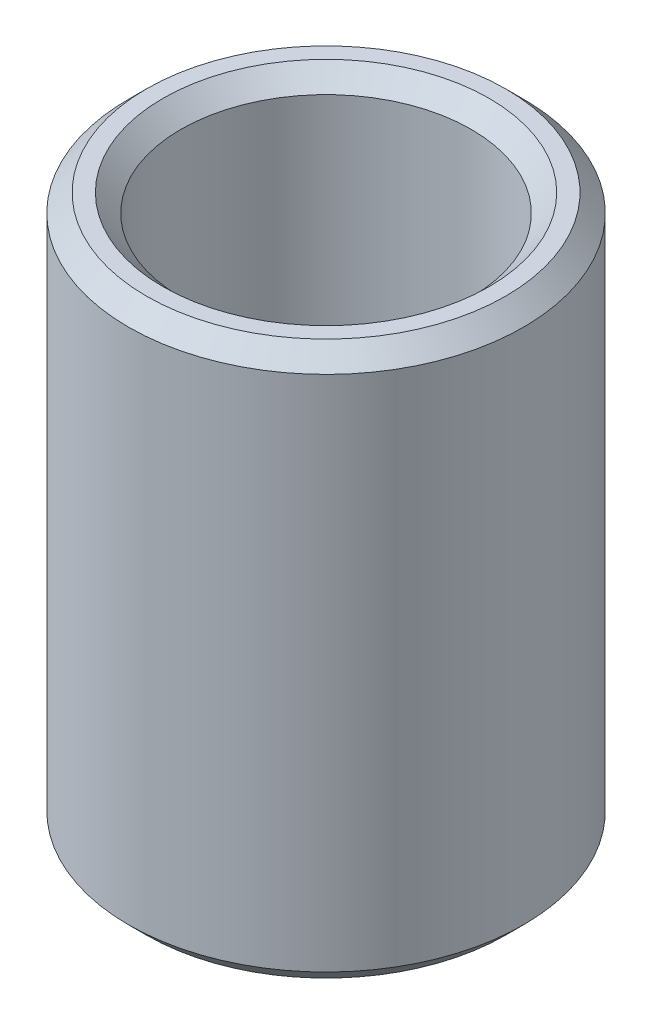
ISO-10303-21;
HEADER;
FILE_DESCRIPTION(('STEP AP214'),'2;1');
FILE_NAME('part.step','',(''),(''),'','','');
FILE_SCHEMA(('AUTOMOTIVE_DESIGN { 1 0 10303 214 1 1 1 1 }'));
ENDSEC;
DATA;
#1=APPLICATION_CONTEXT('core data for automotive mechanical design processes');
#2=APPLICATION_PROTOCOL_DEFINITION('international standard','automotive_design',2000,#1);
#3=PRODUCT_CONTEXT('',#1,'mechanical');
#4=PRODUCT('Part','Part','',(#3));
#5=PRODUCT_RELATED_PRODUCT_CATEGORY('part','',(#4));
#6=PRODUCT_DEFINITION_FORMATION('','',#4);
#7=PRODUCT_DEFINITION_CONTEXT('part definition',#1,'design');
#8=PRODUCT_DEFINITION('design','',#6,#7);
#9=PRODUCT_DEFINITION_SHAPE('','',#8);
#10=(LENGTH_UNIT() NAMED_UNIT(*) SI_UNIT(.MILLI.,.METRE.));
#11=(NAMED_UNIT(*) PLANE_ANGLE_UNIT() SI_UNIT($,.RADIAN.));
#12=(NAMED_UNIT(*) SI_UNIT($,.STERADIAN.) SOLID_ANGLE_UNIT());
#13=UNCERTAINTY_MEASURE_WITH_UNIT(LENGTH_MEASURE(1.E-05),#10,'distance_accuracy_value','');
#14=(GEOMETRIC_REPRESENTATION_CONTEXT(3) GLOBAL_UNCERTAINTY_ASSIGNED_CONTEXT((#13)) GLOBAL_UNIT_ASSIGNED_CONTEXT((#10,
#11,#12)) REPRESENTATION_CONTEXT('',''));
#15=CARTESIAN_POINT('',(0.,0.,0.));
#16=DIRECTION('',(0.,0.,1.));
#17=DIRECTION('',(1.,0.,0.));
#18=AXIS2_PLACEMENT_3D('',#15,#16,#17);
#19=CARTESIAN_POINT('',(0.,119.096016080644,0.));
#20=DIRECTION('',(0.,-1.,0.));
#21=DIRECTION('',(0.,0.,-1.));
#22=AXIS2_PLACEMENT_3D('',#19,#20,#21);
#23=CYLINDRICAL_SURFACE('',#22,42.5);
#24=CARTESIAN_POINT('',(0.,3.85326837927479,0.));
#25=DIRECTION('',(0.,1.,0.));
#26=DIRECTION('',(0.,0.,1.));
#27=AXIS2_PLACEMENT_3D('',#24,#25,#26);
#28=CIRCLE('',#27,42.5);
#29=CARTESIAN_POINT('',(0.,3.85326837927479,42.5));
#30=VERTEX_POINT('',#29);
#31=EDGE_CURVE('E10',#30,#30,#28,.T.);
#32=ORIENTED_EDGE('',*,*,#31,.T.);
#33=EDGE_LOOP('',(#32));
#34=FACE_BOUND('',#33,.T.);
#35=CARTESIAN_POINT('',(0.,115.242747701369,0.));
#36=DIRECTION('',(0.,1.,0.));
#37=DIRECTION('',(0.,0.,1.));
#38=AXIS2_PLACEMENT_3D('',#35,#36,#37);
#39=CIRCLE('',#38,42.5);
#40=CARTESIAN_POINT('',(0.,115.242747701369,42.5));
#41=VERTEX_POINT('',#40);
#42=EDGE_CURVE('E50',#41,#41,#39,.F.);
#43=ORIENTED_EDGE('',*,*,#42,.T.);
#44=EDGE_LOOP('',(#43));
#45=FACE_BOUND('',#44,.T.);
#46=ADVANCED_FACE('F39',(#34,#45),#23,.T.);
#47=CARTESIAN_POINT('',(0.,119.096016080644,0.));
#48=DIRECTION('',(0.,1.,0.));
#49=DIRECTION('',(0.,0.,1.));
#50=AXIS2_PLACEMENT_3D('',#47,#48,#49);
#51=PLANE('',#50);
#52=CARTESIAN_POINT('',(0.,119.096016080644,0.));
#53=DIRECTION('',(0.,1.,0.));
#54=DIRECTION('',(0.,0.,1.));
#55=AXIS2_PLACEMENT_3D('',#52,#53,#54);
#56=CIRCLE('',#55,35.1047241558845);
#57=CARTESIAN_POINT('',(0.,119.096016080644,35.1047241558845));
#58=VERTEX_POINT('',#57);
#59=EDGE_CURVE('E58',#58,#58,#56,.F.);
#60=ORIENTED_EDGE('',*,*,#59,.T.);
#61=EDGE_LOOP('',(#60));
#62=FACE_BOUND('',#61,.T.);
#63=CARTESIAN_POINT('',(0.,119.096016080644,0.));
#64=DIRECTION('',(0.,1.,0.));
#65=DIRECTION('',(0.,0.,1.));
#66=AXIS2_PLACEMENT_3D('',#63,#64,#65);
#67=CIRCLE('',#66,38.6467316207253);
#68=CARTESIAN_POINT('',(0.,119.096016080644,38.6467316207253));
#69=VERTEX_POINT('',#68);
#70=EDGE_CURVE('E61',#69,#69,#67,.T.);
#71=ORIENTED_EDGE('',*,*,#70,.T.);
#72=EDGE_LOOP('',(#71));
#73=FACE_BOUND('',#72,.T.);
#74=ADVANCED_FACE('F88',(#62,#73),#51,.T.);
#75=CARTESIAN_POINT('',(0.,0.,0.));
#76=DIRECTION('',(0.,1.,0.));
#77=DIRECTION('',(0.,0.,1.));
#78=AXIS2_PLACEMENT_3D('',#75,#76,#77);
#79=PLANE('',#78);
#80=CARTESIAN_POINT('',(0.,0.,0.));
#81=DIRECTION('',(0.,1.,0.));
#82=DIRECTION('',(0.,0.,1.));
#83=AXIS2_PLACEMENT_3D('',#80,#81,#82);
#84=CIRCLE('',#83,35.1047241558845);
#85=CARTESIAN_POINT('',(0.,0.,35.1047241558845));
#86=VERTEX_POINT('',#85);
#87=EDGE_CURVE('E51',#86,#86,#84,.T.);
#88=ORIENTED_EDGE('',*,*,#87,.T.);
#89=EDGE_LOOP('',(#88));
#90=FACE_BOUND('',#89,.T.);
#91=CARTESIAN_POINT('',(0.,0.,0.));
#92=DIRECTION('',(0.,1.,0.));
#93=DIRECTION('',(0.,0.,1.));
#94=AXIS2_PLACEMENT_3D('',#91,#92,#93);
#95=CIRCLE('',#94,38.6467316207252);
#96=CARTESIAN_POINT('',(0.,0.,38.6467316207252));
#97=VERTEX_POINT('',#96);
#98=EDGE_CURVE('E54',#97,#97,#95,.F.);
#99=ORIENTED_EDGE('',*,*,#98,.T.);
#100=EDGE_LOOP('',(#99));
#101=FACE_BOUND('',#100,.T.);
#102=ADVANCED_FACE('F83',(#90,#101),#79,.F.);
#103=CARTESIAN_POINT('',(0.,119.096016080644,0.));
#104=DIRECTION('',(0.,-1.,0.));
#105=DIRECTION('',(0.,0.,-1.));
#106=AXIS2_PLACEMENT_3D('',#103,#104,#105);
#107=CYLINDRICAL_SURFACE('',#106,31.2514557766097);
#108=CARTESIAN_POINT('',(0.,115.242747701369,0.));
#109=DIRECTION('',(0.,1.,0.));
#110=DIRECTION('',(0.,0.,1.));
#111=AXIS2_PLACEMENT_3D('',#108,#109,#110);
#112=CIRCLE('',#111,31.2514557766097);
#113=CARTESIAN_POINT('',(0.,115.242747701369,31.2514557766097));
#114=VERTEX_POINT('',#113);
#115=EDGE_CURVE('E67',#114,#114,#112,.T.);
#116=ORIENTED_EDGE('',*,*,#115,.T.);
#117=EDGE_LOOP('',(#116));
#118=FACE_BOUND('',#117,.T.);
#119=CARTESIAN_POINT('',(0.,3.85326837927477,0.));
#120=DIRECTION('',(0.,1.,0.));
#121=DIRECTION('',(0.,0.,1.));
#122=AXIS2_PLACEMENT_3D('',#119,#120,#121);
#123=CIRCLE('',#122,31.2514557766097);
#124=CARTESIAN_POINT('',(0.,3.85326837927477,31.2514557766097));
#125=VERTEX_POINT('',#124);
#126=EDGE_CURVE('E69',#125,#125,#123,.F.);
#127=ORIENTED_EDGE('',*,*,#126,.T.);
#128=EDGE_LOOP('',(#127));
#129=FACE_BOUND('',#128,.T.);
#130=ADVANCED_FACE('F71',(#118,#129),#107,.F.);
#131=CARTESIAN_POINT('',(0.,115.242747701369,0.));
#132=DIRECTION('',(0.,1.,0.));
#133=DIRECTION('',(0.,0.,1.));
#134=AXIS2_PLACEMENT_3D('',#131,#132,#133);
#135=CONICAL_SURFACE('',#134,31.2514557766097,0.785398163397451);
#136=ORIENTED_EDGE('',*,*,#59,.F.);
#137=EDGE_LOOP('',(#136));
#138=FACE_BOUND('',#137,.T.);
#139=ORIENTED_EDGE('',*,*,#115,.F.);
#140=EDGE_LOOP('',(#139));
#141=FACE_BOUND('',#140,.T.);
#142=ADVANCED_FACE('F77',(#138,#141),#135,.F.);
#143=CARTESIAN_POINT('',(0.,0.,0.));
#144=DIRECTION('',(0.,-1.,0.));
#145=DIRECTION('',(0.,0.,-1.));
#146=AXIS2_PLACEMENT_3D('',#143,#144,#145);
#147=CONICAL_SURFACE('',#146,35.1047241558845,0.785398163397446);
#148=ORIENTED_EDGE('',*,*,#126,.F.);
#149=EDGE_LOOP('',(#148));
#150=FACE_BOUND('',#149,.T.);
#151=ORIENTED_EDGE('',*,*,#87,.F.);
#152=EDGE_LOOP('',(#151));
#153=FACE_BOUND('',#152,.T.);
#154=ADVANCED_FACE('F73',(#150,#153),#147,.F.);
#155=CARTESIAN_POINT('',(0.,3.85326837927479,0.));
#156=DIRECTION('',(0.,1.,0.));
#157=DIRECTION('',(0.,0.,1.));
#158=AXIS2_PLACEMENT_3D('',#155,#156,#157);
#159=CONICAL_SURFACE('',#158,42.5,0.78539816339745);
#160=CARTESIAN_POINT('',(0.,0.,38.6467316207252));
#161=CARTESIAN_POINT('',(0.,0.0401382122841138,38.6868698330093));
#162=CARTESIAN_POINT('',(0.,0.0802764245682255,38.7270080452934));
#163=CARTESIAN_POINT('',(0.,0.160552849136449,38.8072844698617));
#164=CARTESIAN_POINT('',(0.,0.200691061420561,38.8474226821458));
#165=CARTESIAN_POINT('',(0.,0.280967485988786,38.927699106714));
#166=CARTESIAN_POINT('',(0.,0.321105698272899,38.9678373189981));
#167=CARTESIAN_POINT('',(0.,0.401382122841124,39.0481137435663));
#168=CARTESIAN_POINT('',(0.,0.441520335125235,39.0882519558504));
#169=CARTESIAN_POINT('',(0.,0.521796759693459,39.1685283804187));
#170=CARTESIAN_POINT('',(0.,0.561934971977573,39.2086665927028));
#171=CARTESIAN_POINT('',(0.,0.642211396545798,39.288943017271));
#172=CARTESIAN_POINT('',(0.,0.682349608829909,39.3290812295551));
#173=CARTESIAN_POINT('',(0.,0.762626033398134,39.4093576541233));
#174=CARTESIAN_POINT('',(0.,0.802764245682247,39.4494958664075));
#175=CARTESIAN_POINT('',(0.,0.883040670250472,39.5297722909757));
#176=CARTESIAN_POINT('',(0.,0.923178882534583,39.5699105032598));
#177=CARTESIAN_POINT('',(0.,1.00345530710281,39.650186927828));
#178=CARTESIAN_POINT('',(0.,1.04359351938692,39.6903251401121));
#179=CARTESIAN_POINT('',(0.,1.12386994395515,39.7706015646804));
#180=CARTESIAN_POINT('',(0.,1.16400815623926,39.8107397769645));
#181=CARTESIAN_POINT('',(0.,1.24428458080748,39.8910162015327));
#182=CARTESIAN_POINT('',(0.,1.2844227930916,39.9311544138168));
#183=CARTESIAN_POINT('',(0.,1.36469921765982,40.011430838385));
#184=CARTESIAN_POINT('',(0.,1.40483742994393,40.0515690506691));
#185=CARTESIAN_POINT('',(0.,1.48511385451216,40.1318454752374));
#186=CARTESIAN_POINT('',(0.,1.52525206679627,40.1719836875215));
#187=CARTESIAN_POINT('',(0.,1.60552849136449,40.2522601120897));
#188=CARTESIAN_POINT('',(0.,1.64566670364861,40.2923983243738));
#189=CARTESIAN_POINT('',(0.,1.72594312821683,40.372674748942));
#190=CARTESIAN_POINT('',(0.,1.76608134050094,40.4128129612262));
#191=CARTESIAN_POINT('',(0.,1.84635776506917,40.4930893857944));
#192=CARTESIAN_POINT('',(0.,1.88649597735328,40.5332275980785));
#193=CARTESIAN_POINT('',(0.,1.9667724019215,40.6135040226467));
#194=CARTESIAN_POINT('',(0.,2.00691061420562,40.6536422349308));
#195=CARTESIAN_POINT('',(0.,2.08718703877384,40.7339186594991));
#196=CARTESIAN_POINT('',(0.,2.12732525105795,40.7740568717832));
#197=CARTESIAN_POINT('',(0.,2.20760167562618,40.8543332963514));
#198=CARTESIAN_POINT('',(0.,2.24773988791029,40.8944715086355));
#199=CARTESIAN_POINT('',(0.,2.32801631247852,40.9747479332037));
#200=CARTESIAN_POINT('',(0.,2.36815452476263,41.0148861454878));
#201=CARTESIAN_POINT('',(0.,2.44843094933085,41.0951625700561));
#202=CARTESIAN_POINT('',(0.,2.48856916161497,41.1353007823402));
#203=CARTESIAN_POINT('',(0.,2.56884558618319,41.2155772069084));
#204=CARTESIAN_POINT('',(0.,2.6089837984673,41.2557154191925));
#205=CARTESIAN_POINT('',(0.,2.68926022303553,41.3359918437607));
#206=CARTESIAN_POINT('',(0.,2.72939843531964,41.3761300560449));
#207=CARTESIAN_POINT('',(0.,2.80967485988786,41.4564064806131));
#208=CARTESIAN_POINT('',(0.,2.84981307217198,41.4965446928972));
#209=CARTESIAN_POINT('',(0.,2.9300894967402,41.5768211174654));
#210=CARTESIAN_POINT('',(0.,2.97022770902431,41.6169593297495));
#211=CARTESIAN_POINT('',(0.,3.05050413359254,41.6972357543178));
#212=CARTESIAN_POINT('',(0.,3.09064234587665,41.7373739666019));
#213=CARTESIAN_POINT('',(0.,3.17091877044487,41.8176503911701));
#214=CARTESIAN_POINT('',(0.,3.21105698272899,41.8577886034542));
#215=CARTESIAN_POINT('',(0.,3.29133340729721,41.9380650280224));
#216=CARTESIAN_POINT('',(0.,3.33147161958132,41.9782032403065));
#217=CARTESIAN_POINT('',(0.,3.41174804414955,42.0584796648748));
#218=CARTESIAN_POINT('',(0.,3.45188625643366,42.0986178771589));
#219=CARTESIAN_POINT('',(0.,3.53216268100189,42.1788943017271));
#220=CARTESIAN_POINT('',(0.,3.572300893286,42.2190325140112));
#221=CARTESIAN_POINT('',(0.,3.65257731785422,42.2993089385795));
#222=CARTESIAN_POINT('',(0.,3.69271553013834,42.3394471508636));
#223=CARTESIAN_POINT('',(0.,3.77299195470656,42.4197235754318));
#224=CARTESIAN_POINT('',(0.,3.81313016699067,42.4598617877159));
#225=CARTESIAN_POINT('',(0.,3.85326837927479,42.5));
#226=B_SPLINE_CURVE_WITH_KNOTS('',3,(#160,#161,#162,#163,#164,#165,#166,#167,#168,#169,#170,
#171,#172,#173,#174,#175,#176,#177,#178,#179,#180,#181,#182,#183,#184,#185,#186,#187,#188,#189,
#190,#191,#192,#193,#194,#195,#196,#197,#198,#199,#200,#201,#202,#203,#204,#205,#206,#207,#208,
#209,#210,#211,#212,#213,#214,#215,#216,#217,#218,#219,#220,#221,#222,#223,#224,#225),
.UNSPECIFIED.,.F.,.F.,(4,2,2,2,2,2,2,2,2,2,2,2,2,2,2,2,2,2,2,2,2,2,2,2,2,2,2,2,2,2,2,2,4),(0.,
0.170292012544804,0.340584025089613,0.510876037634417,0.681168050179226,0.85146006272403,
1.02175207526884,1.19204408781364,1.36233610035845,1.53262811290326,1.70292012544806,
1.87321213799287,2.04350415053768,2.21379616308248,2.38408817562729,2.55438018817209,
2.7246722007169,2.89496421326171,3.06525622580652,3.23554823835132,3.40584025089613,
3.57613226344093,3.74642427598574,3.91671628853055,4.08700830107535,4.25730031362016,
4.42759232616497,4.59788433870978,4.76817635125458,4.93846836379938,5.10876037634419,
5.279052388889,5.4493444014338),.UNSPECIFIED.);
#227=EDGE_CURVE('BSEAM76',#97,#30,#226,.T.);
#228=ORIENTED_EDGE('',*,*,#98,.F.);
#229=ORIENTED_EDGE('',*,*,#31,.F.);
#230=ORIENTED_EDGE('',*,*,#227,.T.);
#231=ORIENTED_EDGE('',*,*,#227,.F.);
#232=EDGE_LOOP('',(#228,#230,#229,#231));
#233=FACE_BOUND('',#232,.T.);
#234=ADVANCED_FACE('F76',(#233),#159,.T.);
#235=CARTESIAN_POINT('',(0.,119.096016080644,0.));
#236=DIRECTION('',(0.,-1.,0.));
#237=DIRECTION('',(0.,0.,-1.));
#238=AXIS2_PLACEMENT_3D('',#235,#236,#237);
#239=CONICAL_SURFACE('',#238,38.6467316207253,0.785398163397443);
#240=ORIENTED_EDGE('',*,*,#42,.F.);
#241=EDGE_LOOP('',(#240));
#242=FACE_BOUND('',#241,.T.);
#243=ORIENTED_EDGE('',*,*,#70,.F.);
#244=EDGE_LOOP('',(#243));
#245=FACE_BOUND('',#244,.T.);
#246=ADVANCED_FACE('F45',(#242,#245),#239,.T.);
#247=CLOSED_SHELL('',(#46,#74,#102,#130,#142,#154,#234,#246));
#248=MANIFOLD_SOLID_BREP('B2',#247);
#249=ADVANCED_BREP_SHAPE_REPRESENTATION('',(#18,#248),#14);
#250=SHAPE_DEFINITION_REPRESENTATION(#9,#249);
ENDSEC;
END-ISO-10303-21;
